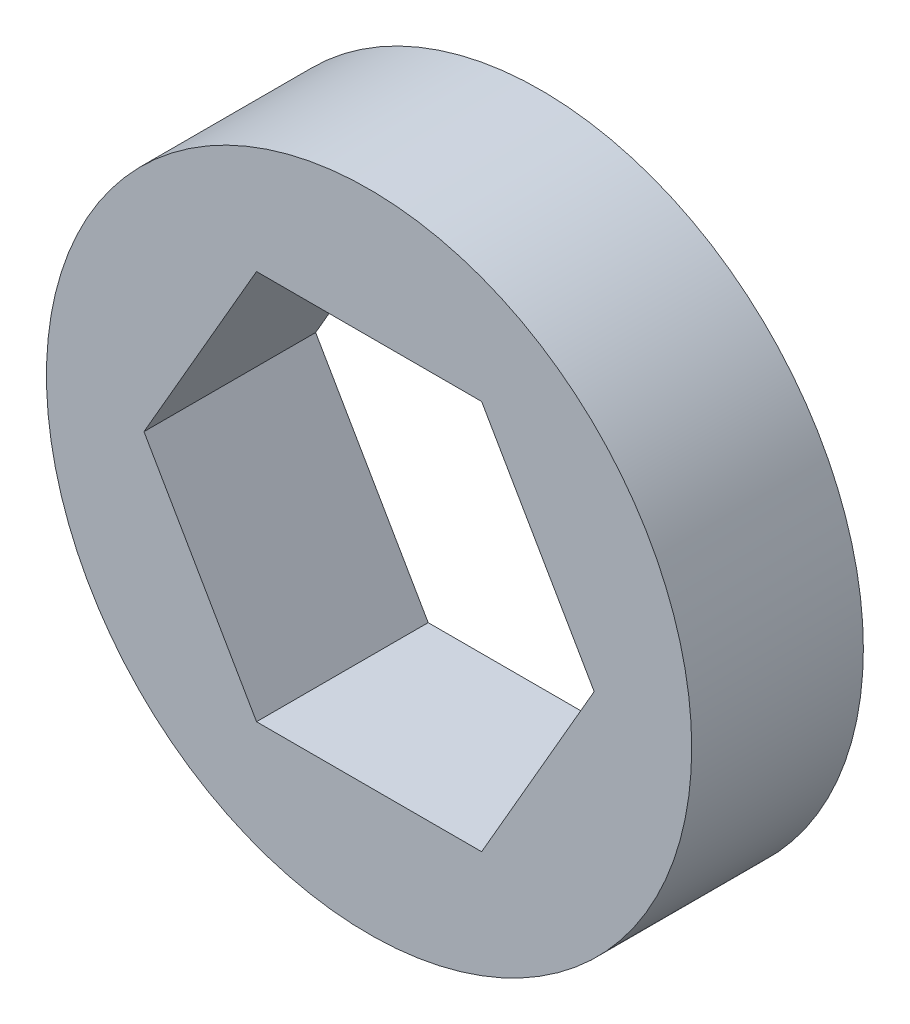
ISO-10303-21;
HEADER;
FILE_DESCRIPTION(('STEP AP214'),'2;1');
FILE_NAME('part.step','',(''),(''),'','','');
FILE_SCHEMA(('AUTOMOTIVE_DESIGN { 1 0 10303 214 1 1 1 1 }'));
ENDSEC;
DATA;
#1=APPLICATION_CONTEXT('core data for automotive mechanical design processes');
#2=APPLICATION_PROTOCOL_DEFINITION('international standard','automotive_design',2000,#1);
#3=PRODUCT_CONTEXT('',#1,'mechanical');
#4=PRODUCT('Part','Part','',(#3));
#5=PRODUCT_RELATED_PRODUCT_CATEGORY('part','',(#4));
#6=PRODUCT_DEFINITION_FORMATION('','',#4);
#7=PRODUCT_DEFINITION_CONTEXT('part definition',#1,'design');
#8=PRODUCT_DEFINITION('design','',#6,#7);
#9=PRODUCT_DEFINITION_SHAPE('','',#8);
#10=(LENGTH_UNIT() NAMED_UNIT(*) SI_UNIT(.MILLI.,.METRE.));
#11=(NAMED_UNIT(*) PLANE_ANGLE_UNIT() SI_UNIT($,.RADIAN.));
#12=(NAMED_UNIT(*) SI_UNIT($,.STERADIAN.) SOLID_ANGLE_UNIT());
#13=UNCERTAINTY_MEASURE_WITH_UNIT(LENGTH_MEASURE(1.E-05),#10,'distance_accuracy_value','');
#14=(GEOMETRIC_REPRESENTATION_CONTEXT(3) GLOBAL_UNCERTAINTY_ASSIGNED_CONTEXT((#13)) GLOBAL_UNIT_ASSIGNED_CONTEXT((#10,
#11,#12)) REPRESENTATION_CONTEXT('',''));
#15=CARTESIAN_POINT('',(0.,0.,0.));
#16=DIRECTION('',(0.,0.,1.));
#17=DIRECTION('',(1.,0.,0.));
#18=AXIS2_PLACEMENT_3D('',#15,#16,#17);
#19=CARTESIAN_POINT('',(0.,0.,5.588));
#20=DIRECTION('',(0.,0.,1.));
#21=DIRECTION('',(1.,0.,0.));
#22=AXIS2_PLACEMENT_3D('',#19,#20,#21);
#23=PLANE('',#22);
#24=CARTESIAN_POINT('',(0.,0.,5.588));
#25=DIRECTION('',(0.,0.,1.));
#26=DIRECTION('',(1.,0.,0.));
#27=AXIS2_PLACEMENT_3D('',#24,#25,#26);
#28=CIRCLE('',#27,10.5029);
#29=CARTESIAN_POINT('',(10.5029,0.,5.588));
#30=VERTEX_POINT('',#29);
#31=EDGE_CURVE('E11',#30,#30,#28,.T.);
#32=ORIENTED_EDGE('',*,*,#31,.T.);
#33=EDGE_LOOP('',(#32));
#34=FACE_BOUND('',#33,.T.);
#35=DIRECTION('',(0.500000000000001,-0.866025403784438,0.));
#36=VECTOR('',#35,1.);
#37=CARTESIAN_POINT('',(-7.3279,0.,5.588));
#38=LINE('',#37,#36);
#39=CARTESIAN_POINT('',(-7.3279,0.,5.588));
#40=VERTEX_POINT('',#39);
#41=CARTESIAN_POINT('',(-3.66394999999998,-6.346147556392,5.588));
#42=VERTEX_POINT('',#41);
#43=EDGE_CURVE('E97',#40,#42,#38,.T.);
#44=ORIENTED_EDGE('',*,*,#43,.F.);
#45=DIRECTION('',(-0.499999999999995,-0.866025403784442,0.));
#46=VECTOR('',#45,1.);
#47=CARTESIAN_POINT('',(-3.66395000000007,6.34614755639194,5.588));
#48=LINE('',#47,#46);
#49=CARTESIAN_POINT('',(-3.66395000000007,6.34614755639194,5.588));
#50=VERTEX_POINT('',#49);
#51=EDGE_CURVE('E89',#50,#40,#48,.T.);
#52=ORIENTED_EDGE('',*,*,#51,.F.);
#53=DIRECTION('',(-1.,0.,0.));
#54=VECTOR('',#53,1.);
#55=CARTESIAN_POINT('',(3.66394999999994,6.34614755639202,5.588));
#56=LINE('',#55,#54);
#57=CARTESIAN_POINT('',(3.66394999999994,6.34614755639202,5.588));
#58=VERTEX_POINT('',#57);
#59=EDGE_CURVE('E117',#58,#50,#56,.T.);
#60=ORIENTED_EDGE('',*,*,#59,.F.);
#61=DIRECTION('',(-0.500000000000007,0.866025403784435,0.));
#62=VECTOR('',#61,1.);
#63=CARTESIAN_POINT('',(7.3279,0.,5.588));
#64=LINE('',#63,#62);
#65=CARTESIAN_POINT('',(7.3279,0.,5.588));
#66=VERTEX_POINT('',#65);
#67=EDGE_CURVE('E115',#66,#58,#64,.T.);
#68=ORIENTED_EDGE('',*,*,#67,.F.);
#69=DIRECTION('',(0.499999999999995,0.866025403784442,0.));
#70=VECTOR('',#69,1.);
#71=CARTESIAN_POINT('',(3.66395000000003,-6.34614755639197,5.588));
#72=LINE('',#71,#70);
#73=CARTESIAN_POINT('',(3.66395000000003,-6.34614755639197,5.588));
#74=VERTEX_POINT('',#73);
#75=EDGE_CURVE('E111',#74,#66,#72,.T.);
#76=ORIENTED_EDGE('',*,*,#75,.F.);
#77=DIRECTION('',(1.,0.,0.));
#78=VECTOR('',#77,1.);
#79=CARTESIAN_POINT('',(-3.66394999999998,-6.346147556392,5.588));
#80=LINE('',#79,#78);
#81=EDGE_CURVE('E109',#42,#74,#80,.T.);
#82=ORIENTED_EDGE('',*,*,#81,.F.);
#83=EDGE_LOOP('',(#44,#52,#60,#68,#76,#82));
#84=FACE_BOUND('',#83,.T.);
#85=ADVANCED_FACE('F36',(#34,#84),#23,.T.);
#86=CARTESIAN_POINT('',(0.,0.,0.));
#87=DIRECTION('',(0.,0.,1.));
#88=DIRECTION('',(1.,0.,0.));
#89=AXIS2_PLACEMENT_3D('',#86,#87,#88);
#90=PLANE('',#89);
#91=CARTESIAN_POINT('',(0.,0.,0.));
#92=DIRECTION('',(0.,0.,1.));
#93=DIRECTION('',(1.,0.,0.));
#94=AXIS2_PLACEMENT_3D('',#91,#92,#93);
#95=CIRCLE('',#94,10.5029);
#96=CARTESIAN_POINT('',(10.5029,0.,0.));
#97=VERTEX_POINT('',#96);
#98=EDGE_CURVE('E40',#97,#97,#95,.T.);
#99=ORIENTED_EDGE('',*,*,#98,.F.);
#100=EDGE_LOOP('',(#99));
#101=FACE_BOUND('',#100,.T.);
#102=DIRECTION('',(-0.499999999999995,-0.866025403784442,0.));
#103=VECTOR('',#102,1.);
#104=CARTESIAN_POINT('',(-3.66395000000007,6.34614755639194,0.));
#105=LINE('',#104,#103);
#106=CARTESIAN_POINT('',(-3.66395000000007,6.34614755639194,0.));
#107=VERTEX_POINT('',#106);
#108=CARTESIAN_POINT('',(-7.3279,0.,0.));
#109=VERTEX_POINT('',#108);
#110=EDGE_CURVE('E59',#107,#109,#105,.T.);
#111=ORIENTED_EDGE('',*,*,#110,.T.);
#112=DIRECTION('',(0.500000000000001,-0.866025403784438,0.));
#113=VECTOR('',#112,1.);
#114=CARTESIAN_POINT('',(-7.3279,0.,0.));
#115=LINE('',#114,#113);
#116=CARTESIAN_POINT('',(-3.66394999999998,-6.346147556392,0.));
#117=VERTEX_POINT('',#116);
#118=EDGE_CURVE('E104',#109,#117,#115,.T.);
#119=ORIENTED_EDGE('',*,*,#118,.T.);
#120=DIRECTION('',(1.,0.,0.));
#121=VECTOR('',#120,1.);
#122=CARTESIAN_POINT('',(-3.66394999999998,-6.346147556392,0.));
#123=LINE('',#122,#121);
#124=CARTESIAN_POINT('',(3.66395000000003,-6.34614755639197,0.));
#125=VERTEX_POINT('',#124);
#126=EDGE_CURVE('E121',#117,#125,#123,.T.);
#127=ORIENTED_EDGE('',*,*,#126,.T.);
#128=DIRECTION('',(0.499999999999995,0.866025403784442,0.));
#129=VECTOR('',#128,1.);
#130=CARTESIAN_POINT('',(3.66395000000003,-6.34614755639197,0.));
#131=LINE('',#130,#129);
#132=CARTESIAN_POINT('',(7.3279,0.,0.));
#133=VERTEX_POINT('',#132);
#134=EDGE_CURVE('E124',#125,#133,#131,.T.);
#135=ORIENTED_EDGE('',*,*,#134,.T.);
#136=DIRECTION('',(-0.500000000000007,0.866025403784435,0.));
#137=VECTOR('',#136,1.);
#138=CARTESIAN_POINT('',(7.3279,0.,0.));
#139=LINE('',#138,#137);
#140=CARTESIAN_POINT('',(3.66394999999994,6.34614755639202,0.));
#141=VERTEX_POINT('',#140);
#142=EDGE_CURVE('E127',#133,#141,#139,.T.);
#143=ORIENTED_EDGE('',*,*,#142,.T.);
#144=DIRECTION('',(-1.,0.,0.));
#145=VECTOR('',#144,1.);
#146=CARTESIAN_POINT('',(3.66394999999994,6.34614755639202,0.));
#147=LINE('',#146,#145);
#148=EDGE_CURVE('E98',#141,#107,#147,.T.);
#149=ORIENTED_EDGE('',*,*,#148,.T.);
#150=EDGE_LOOP('',(#111,#119,#127,#135,#143,#149));
#151=FACE_BOUND('',#150,.T.);
#152=ADVANCED_FACE('F144',(#101,#151),#90,.F.);
#153=CARTESIAN_POINT('',(0.,0.,5.588));
#154=DIRECTION('',(0.,0.,-1.));
#155=DIRECTION('',(-1.,0.,0.));
#156=AXIS2_PLACEMENT_3D('',#153,#154,#155);
#157=CYLINDRICAL_SURFACE('',#156,10.5029);
#158=ORIENTED_EDGE('',*,*,#31,.F.);
#159=EDGE_LOOP('',(#158));
#160=FACE_BOUND('',#159,.T.);
#161=ORIENTED_EDGE('',*,*,#98,.T.);
#162=EDGE_LOOP('',(#161));
#163=FACE_BOUND('',#162,.T.);
#164=ADVANCED_FACE('F38',(#160,#163),#157,.T.);
#165=CARTESIAN_POINT('',(-3.66395000000007,6.34614755639194,5.588));
#166=DIRECTION('',(0.866025403784442,-0.499999999999995,0.));
#167=DIRECTION('',(0.499999999999995,0.866025403784441,0.));
#168=AXIS2_PLACEMENT_3D('',#165,#166,#167);
#169=PLANE('',#168);
#170=ORIENTED_EDGE('',*,*,#110,.F.);
#171=DIRECTION('',(0.,0.,-1.));
#172=VECTOR('',#171,1.);
#173=CARTESIAN_POINT('',(-3.66395000000007,6.34614755639194,5.588));
#174=LINE('',#173,#172);
#175=EDGE_CURVE('E93',#50,#107,#174,.T.);
#176=ORIENTED_EDGE('',*,*,#175,.F.);
#177=ORIENTED_EDGE('',*,*,#51,.T.);
#178=DIRECTION('',(0.,0.,-1.));
#179=VECTOR('',#178,1.);
#180=CARTESIAN_POINT('',(-7.3279,0.,5.588));
#181=LINE('',#180,#179);
#182=EDGE_CURVE('E92',#40,#109,#181,.T.);
#183=ORIENTED_EDGE('',*,*,#182,.T.);
#184=EDGE_LOOP('',(#170,#176,#177,#183));
#185=FACE_BOUND('',#184,.T.);
#186=ADVANCED_FACE('F91',(#185),#169,.T.);
#187=CARTESIAN_POINT('',(-7.3279,0.,5.588));
#188=DIRECTION('',(0.866025403784438,0.500000000000001,0.));
#189=DIRECTION('',(-0.500000000000001,0.866025403784438,0.));
#190=AXIS2_PLACEMENT_3D('',#187,#188,#189);
#191=PLANE('',#190);
#192=ORIENTED_EDGE('',*,*,#118,.F.);
#193=ORIENTED_EDGE('',*,*,#182,.F.);
#194=ORIENTED_EDGE('',*,*,#43,.T.);
#195=DIRECTION('',(0.,0.,-1.));
#196=VECTOR('',#195,1.);
#197=CARTESIAN_POINT('',(-3.66394999999998,-6.346147556392,5.588));
#198=LINE('',#197,#196);
#199=EDGE_CURVE('E105',#42,#117,#198,.T.);
#200=ORIENTED_EDGE('',*,*,#199,.T.);
#201=EDGE_LOOP('',(#192,#193,#194,#200));
#202=FACE_BOUND('',#201,.T.);
#203=ADVANCED_FACE('F101',(#202),#191,.T.);
#204=CARTESIAN_POINT('',(-3.66394999999998,-6.346147556392,5.588));
#205=DIRECTION('',(0.,1.,0.));
#206=DIRECTION('',(-1.,0.,0.));
#207=AXIS2_PLACEMENT_3D('',#204,#205,#206);
#208=PLANE('',#207);
#209=ORIENTED_EDGE('',*,*,#126,.F.);
#210=ORIENTED_EDGE('',*,*,#199,.F.);
#211=ORIENTED_EDGE('',*,*,#81,.T.);
#212=DIRECTION('',(0.,0.,-1.));
#213=VECTOR('',#212,1.);
#214=CARTESIAN_POINT('',(3.66395000000003,-6.34614755639197,5.588));
#215=LINE('',#214,#213);
#216=EDGE_CURVE('E136',#74,#125,#215,.T.);
#217=ORIENTED_EDGE('',*,*,#216,.T.);
#218=EDGE_LOOP('',(#209,#210,#211,#217));
#219=FACE_BOUND('',#218,.T.);
#220=ADVANCED_FACE('F140',(#219),#208,.T.);
#221=CARTESIAN_POINT('',(3.66395000000003,-6.34614755639197,5.588));
#222=DIRECTION('',(-0.866025403784442,0.499999999999995,0.));
#223=DIRECTION('',(-0.499999999999995,-0.866025403784442,0.));
#224=AXIS2_PLACEMENT_3D('',#221,#222,#223);
#225=PLANE('',#224);
#226=ORIENTED_EDGE('',*,*,#134,.F.);
#227=ORIENTED_EDGE('',*,*,#216,.F.);
#228=ORIENTED_EDGE('',*,*,#75,.T.);
#229=DIRECTION('',(0.,0.,-1.));
#230=VECTOR('',#229,1.);
#231=CARTESIAN_POINT('',(7.3279,0.,5.588));
#232=LINE('',#231,#230);
#233=EDGE_CURVE('E134',#66,#133,#232,.T.);
#234=ORIENTED_EDGE('',*,*,#233,.T.);
#235=EDGE_LOOP('',(#226,#227,#228,#234));
#236=FACE_BOUND('',#235,.T.);
#237=ADVANCED_FACE('F152',(#236),#225,.T.);
#238=CARTESIAN_POINT('',(7.3279,0.,5.588));
#239=DIRECTION('',(-0.866025403784435,-0.500000000000007,0.));
#240=DIRECTION('',(0.500000000000007,-0.866025403784435,0.));
#241=AXIS2_PLACEMENT_3D('',#238,#239,#240);
#242=PLANE('',#241);
#243=ORIENTED_EDGE('',*,*,#142,.F.);
#244=ORIENTED_EDGE('',*,*,#233,.F.);
#245=ORIENTED_EDGE('',*,*,#67,.T.);
#246=DIRECTION('',(0.,0.,-1.));
#247=VECTOR('',#246,1.);
#248=CARTESIAN_POINT('',(3.66394999999994,6.34614755639202,5.588));
#249=LINE('',#248,#247);
#250=EDGE_CURVE('E51',#58,#141,#249,.T.);
#251=ORIENTED_EDGE('',*,*,#250,.T.);
#252=EDGE_LOOP('',(#243,#244,#245,#251));
#253=FACE_BOUND('',#252,.T.);
#254=ADVANCED_FACE('F150',(#253),#242,.T.);
#255=CARTESIAN_POINT('',(3.66394999999994,6.34614755639202,5.588));
#256=DIRECTION('',(0.,-1.,0.));
#257=DIRECTION('',(1.,0.,0.));
#258=AXIS2_PLACEMENT_3D('',#255,#256,#257);
#259=PLANE('',#258);
#260=ORIENTED_EDGE('',*,*,#148,.F.);
#261=ORIENTED_EDGE('',*,*,#250,.F.);
#262=ORIENTED_EDGE('',*,*,#59,.T.);
#263=ORIENTED_EDGE('',*,*,#175,.T.);
#264=EDGE_LOOP('',(#260,#261,#262,#263));
#265=FACE_BOUND('',#264,.T.);
#266=ADVANCED_FACE('F146',(#265),#259,.T.);
#267=CLOSED_SHELL('',(#85,#152,#164,#186,#203,#220,#237,#254,#266));
#268=MANIFOLD_SOLID_BREP('B2',#267);
#269=ADVANCED_BREP_SHAPE_REPRESENTATION('',(#18,#268),#14);
#270=SHAPE_DEFINITION_REPRESENTATION(#9,#269);
ENDSEC;
END-ISO-10303-21;
